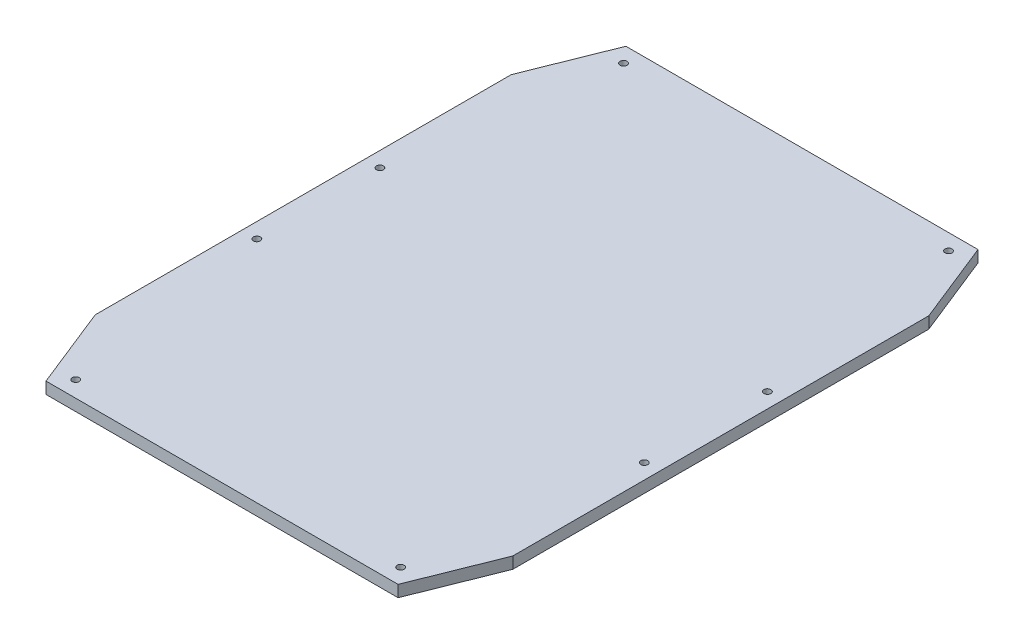
ISO-10303-21;
HEADER;
FILE_DESCRIPTION(('STEP AP214'),'2;1');
FILE_NAME('part.step','',(''),(''),'','','');
FILE_SCHEMA(('AUTOMOTIVE_DESIGN { 1 0 10303 214 1 1 1 1 }'));
ENDSEC;
DATA;
#1=APPLICATION_CONTEXT('core data for automotive mechanical design processes');
#2=APPLICATION_PROTOCOL_DEFINITION('international standard','automotive_design',2000,#1);
#3=PRODUCT_CONTEXT('',#1,'mechanical');
#4=PRODUCT('Part','Part','',(#3));
#5=PRODUCT_RELATED_PRODUCT_CATEGORY('part','',(#4));
#6=PRODUCT_DEFINITION_FORMATION('','',#4);
#7=PRODUCT_DEFINITION_CONTEXT('part definition',#1,'design');
#8=PRODUCT_DEFINITION('design','',#6,#7);
#9=PRODUCT_DEFINITION_SHAPE('','',#8);
#10=(LENGTH_UNIT() NAMED_UNIT(*) SI_UNIT(.MILLI.,.METRE.));
#11=(NAMED_UNIT(*) PLANE_ANGLE_UNIT() SI_UNIT($,.RADIAN.));
#12=(NAMED_UNIT(*) SI_UNIT($,.STERADIAN.) SOLID_ANGLE_UNIT());
#13=UNCERTAINTY_MEASURE_WITH_UNIT(LENGTH_MEASURE(1.E-05),#10,'distance_accuracy_value','');
#14=(GEOMETRIC_REPRESENTATION_CONTEXT(3) GLOBAL_UNCERTAINTY_ASSIGNED_CONTEXT((#13)) GLOBAL_UNIT_ASSIGNED_CONTEXT((#10,
#11,#12)) REPRESENTATION_CONTEXT('',''));
#15=CARTESIAN_POINT('',(0.,0.,0.));
#16=DIRECTION('',(0.,0.,1.));
#17=DIRECTION('',(1.,0.,0.));
#18=AXIS2_PLACEMENT_3D('',#15,#16,#17);
#19=CARTESIAN_POINT('',(0.,5.,0.));
#20=DIRECTION('',(0.928485826880912,0.,-0.371367835550239));
#21=DIRECTION('',(-0.371367835550239,0.,-0.928485826880912));
#22=AXIS2_PLACEMENT_3D('',#19,#20,#21);
#23=PLANE('',#22);
#24=DIRECTION('',(0.371367835550239,0.,0.928485826880912));
#25=VECTOR('',#24,1.);
#26=CARTESIAN_POINT('',(0.,0.,0.));
#27=LINE('',#26,#25);
#28=CARTESIAN_POINT('',(-14.1231187859756,0.,-35.3103159962811));
#29=VERTEX_POINT('',#28);
#30=CARTESIAN_POINT('',(0.,0.,0.));
#31=VERTEX_POINT('',#30);
#32=EDGE_CURVE('E147',#29,#31,#27,.T.);
#33=ORIENTED_EDGE('',*,*,#32,.T.);
#34=DIRECTION('',(0.,-1.,0.));
#35=VECTOR('',#34,1.);
#36=CARTESIAN_POINT('',(0.,5.,0.));
#37=LINE('',#36,#35);
#38=CARTESIAN_POINT('',(0.,5.,0.));
#39=VERTEX_POINT('',#38);
#40=EDGE_CURVE('E11',#39,#31,#37,.T.);
#41=ORIENTED_EDGE('',*,*,#40,.F.);
#42=DIRECTION('',(0.371367835550239,0.,0.928485826880912));
#43=VECTOR('',#42,1.);
#44=CARTESIAN_POINT('',(0.,5.,0.));
#45=LINE('',#44,#43);
#46=CARTESIAN_POINT('',(-14.1231187859756,5.,-35.3103159962811));
#47=VERTEX_POINT('',#46);
#48=EDGE_CURVE('E169',#47,#39,#45,.T.);
#49=ORIENTED_EDGE('',*,*,#48,.F.);
#50=DIRECTION('',(0.,-1.,0.));
#51=VECTOR('',#50,1.);
#52=CARTESIAN_POINT('',(-14.1231187859756,5.,-35.3103159962811));
#53=LINE('',#52,#51);
#54=EDGE_CURVE('E143',#47,#29,#53,.T.);
#55=ORIENTED_EDGE('',*,*,#54,.T.);
#56=EDGE_LOOP('',(#33,#41,#49,#55));
#57=FACE_BOUND('',#56,.T.);
#58=ADVANCED_FACE('F44',(#57),#23,.F.);
#59=CARTESIAN_POINT('',(0.,5.,0.));
#60=DIRECTION('',(0.,0.,-1.));
#61=DIRECTION('',(-1.,0.,0.));
#62=AXIS2_PLACEMENT_3D('',#59,#60,#61);
#63=PLANE('',#62);
#64=DIRECTION('',(1.,0.,0.));
#65=VECTOR('',#64,1.);
#66=CARTESIAN_POINT('',(0.,0.,0.));
#67=LINE('',#66,#65);
#68=CARTESIAN_POINT('',(151.72,0.,0.));
#69=VERTEX_POINT('',#68);
#70=EDGE_CURVE('E151',#31,#69,#67,.T.);
#71=ORIENTED_EDGE('',*,*,#70,.T.);
#72=DIRECTION('',(0.,-1.,0.));
#73=VECTOR('',#72,1.);
#74=CARTESIAN_POINT('',(151.72,5.,0.));
#75=LINE('',#74,#73);
#76=CARTESIAN_POINT('',(151.72,5.,0.));
#77=VERTEX_POINT('',#76);
#78=EDGE_CURVE('E54',#77,#69,#75,.T.);
#79=ORIENTED_EDGE('',*,*,#78,.F.);
#80=DIRECTION('',(1.,0.,0.));
#81=VECTOR('',#80,1.);
#82=CARTESIAN_POINT('',(0.,5.,0.));
#83=LINE('',#82,#81);
#84=EDGE_CURVE('E106',#39,#77,#83,.T.);
#85=ORIENTED_EDGE('',*,*,#84,.F.);
#86=ORIENTED_EDGE('',*,*,#40,.T.);
#87=EDGE_LOOP('',(#71,#79,#85,#86));
#88=FACE_BOUND('',#87,.T.);
#89=ADVANCED_FACE('F258',(#88),#63,.F.);
#90=CARTESIAN_POINT('',(151.72,5.,0.));
#91=DIRECTION('',(-0.928485826880912,0.,-0.37136783555024));
#92=DIRECTION('',(-0.37136783555024,0.,0.928485826880912));
#93=AXIS2_PLACEMENT_3D('',#90,#91,#92);
#94=PLANE('',#93);
#95=DIRECTION('',(0.37136783555024,0.,-0.928485826880912));
#96=VECTOR('',#95,1.);
#97=CARTESIAN_POINT('',(151.72,0.,0.));
#98=LINE('',#97,#96);
#99=CARTESIAN_POINT('',(165.843118785976,0.,-35.3103159962811));
#100=VERTEX_POINT('',#99);
#101=EDGE_CURVE('E154',#69,#100,#98,.T.);
#102=ORIENTED_EDGE('',*,*,#101,.T.);
#103=DIRECTION('',(0.,-1.,0.));
#104=VECTOR('',#103,1.);
#105=CARTESIAN_POINT('',(165.843118785976,5.,-35.3103159962811));
#106=LINE('',#105,#104);
#107=CARTESIAN_POINT('',(165.843118785976,5.,-35.3103159962811));
#108=VERTEX_POINT('',#107);
#109=EDGE_CURVE('E180',#108,#100,#106,.T.);
#110=ORIENTED_EDGE('',*,*,#109,.F.);
#111=DIRECTION('',(0.37136783555024,0.,-0.928485826880912));
#112=VECTOR('',#111,1.);
#113=CARTESIAN_POINT('',(151.72,5.,0.));
#114=LINE('',#113,#112);
#115=EDGE_CURVE('E476',#77,#108,#114,.T.);
#116=ORIENTED_EDGE('',*,*,#115,.F.);
#117=ORIENTED_EDGE('',*,*,#78,.T.);
#118=EDGE_LOOP('',(#102,#110,#116,#117));
#119=FACE_BOUND('',#118,.T.);
#120=ADVANCED_FACE('F262',(#119),#94,.F.);
#121=CARTESIAN_POINT('',(165.843118785976,5.,-35.3103159962811));
#122=DIRECTION('',(-1.,0.,0.));
#123=DIRECTION('',(0.,0.,1.));
#124=AXIS2_PLACEMENT_3D('',#121,#122,#123);
#125=PLANE('',#124);
#126=DIRECTION('',(0.,0.,-1.));
#127=VECTOR('',#126,1.);
#128=CARTESIAN_POINT('',(165.843118785976,0.,-35.3103159962811));
#129=LINE('',#128,#127);
#130=CARTESIAN_POINT('',(165.843118785976,0.,-214.600315996281));
#131=VERTEX_POINT('',#130);
#132=EDGE_CURVE('E157',#100,#131,#129,.T.);
#133=ORIENTED_EDGE('',*,*,#132,.T.);
#134=DIRECTION('',(0.,-1.,0.));
#135=VECTOR('',#134,1.);
#136=CARTESIAN_POINT('',(165.843118785976,5.,-214.600315996281));
#137=LINE('',#136,#135);
#138=CARTESIAN_POINT('',(165.843118785976,5.,-214.600315996281));
#139=VERTEX_POINT('',#138);
#140=EDGE_CURVE('E176',#139,#131,#137,.T.);
#141=ORIENTED_EDGE('',*,*,#140,.F.);
#142=DIRECTION('',(0.,0.,-1.));
#143=VECTOR('',#142,1.);
#144=CARTESIAN_POINT('',(165.843118785976,5.,-35.3103159962811));
#145=LINE('',#144,#143);
#146=EDGE_CURVE('E479',#108,#139,#145,.T.);
#147=ORIENTED_EDGE('',*,*,#146,.F.);
#148=ORIENTED_EDGE('',*,*,#109,.T.);
#149=EDGE_LOOP('',(#133,#141,#147,#148));
#150=FACE_BOUND('',#149,.T.);
#151=ADVANCED_FACE('F266',(#150),#125,.F.);
#152=CARTESIAN_POINT('',(151.72,5.,-249.910631992562));
#153=DIRECTION('',(-0.928485826880911,0.,0.37136783555024));
#154=DIRECTION('',(0.37136783555024,0.,0.928485826880911));
#155=AXIS2_PLACEMENT_3D('',#152,#153,#154);
#156=PLANE('',#155);
#157=DIRECTION('',(-0.37136783555024,0.,-0.928485826880911));
#158=VECTOR('',#157,1.);
#159=CARTESIAN_POINT('',(151.72,0.,-249.910631992562));
#160=LINE('',#159,#158);
#161=CARTESIAN_POINT('',(151.72,0.,-249.910631992562));
#162=VERTEX_POINT('',#161);
#163=EDGE_CURVE('E160',#131,#162,#160,.T.);
#164=ORIENTED_EDGE('',*,*,#163,.T.);
#165=DIRECTION('',(0.,-1.,0.));
#166=VECTOR('',#165,1.);
#167=CARTESIAN_POINT('',(151.72,5.,-249.910631992562));
#168=LINE('',#167,#166);
#169=CARTESIAN_POINT('',(151.72,5.,-249.910631992562));
#170=VERTEX_POINT('',#169);
#171=EDGE_CURVE('E136',#170,#162,#168,.T.);
#172=ORIENTED_EDGE('',*,*,#171,.F.);
#173=DIRECTION('',(-0.37136783555024,0.,-0.928485826880911));
#174=VECTOR('',#173,1.);
#175=CARTESIAN_POINT('',(151.72,5.,-249.910631992562));
#176=LINE('',#175,#174);
#177=EDGE_CURVE('E125',#139,#170,#176,.T.);
#178=ORIENTED_EDGE('',*,*,#177,.F.);
#179=ORIENTED_EDGE('',*,*,#140,.T.);
#180=EDGE_LOOP('',(#164,#172,#178,#179));
#181=FACE_BOUND('',#180,.T.);
#182=ADVANCED_FACE('F272',(#181),#156,.F.);
#183=CARTESIAN_POINT('',(0.,5.,-249.910631992562));
#184=DIRECTION('',(0.,0.,1.));
#185=DIRECTION('',(1.,0.,0.));
#186=AXIS2_PLACEMENT_3D('',#183,#184,#185);
#187=PLANE('',#186);
#188=DIRECTION('',(-1.,0.,0.));
#189=VECTOR('',#188,1.);
#190=CARTESIAN_POINT('',(0.,0.,-249.910631992562));
#191=LINE('',#190,#189);
#192=CARTESIAN_POINT('',(0.,0.,-249.910631992562));
#193=VERTEX_POINT('',#192);
#194=EDGE_CURVE('E134',#162,#193,#191,.T.);
#195=ORIENTED_EDGE('',*,*,#194,.T.);
#196=DIRECTION('',(0.,-1.,0.));
#197=VECTOR('',#196,1.);
#198=CARTESIAN_POINT('',(0.,5.,-249.910631992562));
#199=LINE('',#198,#197);
#200=CARTESIAN_POINT('',(0.,5.,-249.910631992562));
#201=VERTEX_POINT('',#200);
#202=EDGE_CURVE('E131',#201,#193,#199,.T.);
#203=ORIENTED_EDGE('',*,*,#202,.F.);
#204=DIRECTION('',(-1.,0.,0.));
#205=VECTOR('',#204,1.);
#206=CARTESIAN_POINT('',(0.,5.,-249.910631992562));
#207=LINE('',#206,#205);
#208=EDGE_CURVE('E119',#170,#201,#207,.T.);
#209=ORIENTED_EDGE('',*,*,#208,.F.);
#210=ORIENTED_EDGE('',*,*,#171,.T.);
#211=EDGE_LOOP('',(#195,#203,#209,#210));
#212=FACE_BOUND('',#211,.T.);
#213=ADVANCED_FACE('F132',(#212),#187,.F.);
#214=CARTESIAN_POINT('',(0.,5.,-249.910631992562));
#215=DIRECTION('',(0.928485826880912,0.,0.37136783555024));
#216=DIRECTION('',(0.37136783555024,0.,-0.928485826880912));
#217=AXIS2_PLACEMENT_3D('',#214,#215,#216);
#218=PLANE('',#217);
#219=DIRECTION('',(-0.37136783555024,0.,0.928485826880911));
#220=VECTOR('',#219,1.);
#221=CARTESIAN_POINT('',(0.,0.,-249.910631992562));
#222=LINE('',#221,#220);
#223=CARTESIAN_POINT('',(-14.1231187859756,0.,-214.600315996281));
#224=VERTEX_POINT('',#223);
#225=EDGE_CURVE('E92',#193,#224,#222,.T.);
#226=ORIENTED_EDGE('',*,*,#225,.T.);
#227=DIRECTION('',(0.,-1.,0.));
#228=VECTOR('',#227,1.);
#229=CARTESIAN_POINT('',(-14.1231187859756,5.,-214.600315996281));
#230=LINE('',#229,#228);
#231=CARTESIAN_POINT('',(-14.1231187859756,5.,-214.600315996281));
#232=VERTEX_POINT('',#231);
#233=EDGE_CURVE('E137',#232,#224,#230,.T.);
#234=ORIENTED_EDGE('',*,*,#233,.F.);
#235=DIRECTION('',(-0.37136783555024,0.,0.928485826880911));
#236=VECTOR('',#235,1.);
#237=CARTESIAN_POINT('',(0.,5.,-249.910631992562));
#238=LINE('',#237,#236);
#239=EDGE_CURVE('E123',#201,#232,#238,.T.);
#240=ORIENTED_EDGE('',*,*,#239,.F.);
#241=ORIENTED_EDGE('',*,*,#202,.T.);
#242=EDGE_LOOP('',(#226,#234,#240,#241));
#243=FACE_BOUND('',#242,.T.);
#244=ADVANCED_FACE('F139',(#243),#218,.F.);
#245=CARTESIAN_POINT('',(-14.1231187859756,5.,-35.3103159962811));
#246=DIRECTION('',(1.,0.,0.));
#247=DIRECTION('',(0.,0.,-1.));
#248=AXIS2_PLACEMENT_3D('',#245,#246,#247);
#249=PLANE('',#248);
#250=DIRECTION('',(0.,0.,1.));
#251=VECTOR('',#250,1.);
#252=CARTESIAN_POINT('',(-14.1231187859756,0.,-35.3103159962811));
#253=LINE('',#252,#251);
#254=EDGE_CURVE('E98',#224,#29,#253,.T.);
#255=ORIENTED_EDGE('',*,*,#254,.T.);
#256=ORIENTED_EDGE('',*,*,#54,.F.);
#257=DIRECTION('',(0.,0.,1.));
#258=VECTOR('',#257,1.);
#259=CARTESIAN_POINT('',(-14.1231187859756,5.,-35.3103159962811));
#260=LINE('',#259,#258);
#261=EDGE_CURVE('E63',#232,#47,#260,.T.);
#262=ORIENTED_EDGE('',*,*,#261,.F.);
#263=ORIENTED_EDGE('',*,*,#233,.T.);
#264=EDGE_LOOP('',(#255,#256,#262,#263));
#265=FACE_BOUND('',#264,.T.);
#266=ADVANCED_FACE('F246',(#265),#249,.F.);
#267=CARTESIAN_POINT('',(0.,5.,0.));
#268=DIRECTION('',(0.,-1.,0.));
#269=DIRECTION('',(0.,0.,-1.));
#270=AXIS2_PLACEMENT_3D('',#267,#268,#269);
#271=PLANE('',#270);
#272=CARTESIAN_POINT('',(145.883373814949,5.,-6.95212776511848));
#273=DIRECTION('',(0.,1.,0.));
#274=DIRECTION('',(0.,0.,1.));
#275=AXIS2_PLACEMENT_3D('',#272,#273,#274);
#276=CIRCLE('',#275,1.5);
#277=CARTESIAN_POINT('',(145.883373814949,5.,-5.45212776511848));
#278=VERTEX_POINT('',#277);
#279=EDGE_CURVE('E453',#278,#278,#276,.T.);
#280=ORIENTED_EDGE('',*,*,#279,.F.);
#281=EDGE_LOOP('',(#280));
#282=FACE_BOUND('',#281,.T.);
#283=CARTESIAN_POINT('',(5.84089743251317,5.,-6.95212776511853));
#284=DIRECTION('',(0.,1.,0.));
#285=DIRECTION('',(0.,0.,1.));
#286=AXIS2_PLACEMENT_3D('',#283,#284,#285);
#287=CIRCLE('',#286,1.5);
#288=CARTESIAN_POINT('',(5.84089743251317,5.,-5.45212776511853));
#289=VERTEX_POINT('',#288);
#290=EDGE_CURVE('E450',#289,#289,#287,.T.);
#291=ORIENTED_EDGE('',*,*,#290,.F.);
#292=EDGE_LOOP('',(#291));
#293=FACE_BOUND('',#292,.T.);
#294=CARTESIAN_POINT('',(-7.61571773084433,5.,-98.4778533545754));
#295=DIRECTION('',(0.,1.,0.));
#296=DIRECTION('',(0.,0.,1.));
#297=AXIS2_PLACEMENT_3D('',#294,#295,#296);
#298=CIRCLE('',#297,1.5);
#299=CARTESIAN_POINT('',(-7.61571773084433,5.,-96.9778533545754));
#300=VERTEX_POINT('',#299);
#301=EDGE_CURVE('E454',#300,#300,#298,.T.);
#302=ORIENTED_EDGE('',*,*,#301,.F.);
#303=EDGE_LOOP('',(#302));
#304=FACE_BOUND('',#303,.T.);
#305=CARTESIAN_POINT('',(-7.61571773084433,5.,-151.522146645424));
#306=DIRECTION('',(0.,1.,0.));
#307=DIRECTION('',(0.,0.,1.));
#308=AXIS2_PLACEMENT_3D('',#305,#306,#307);
#309=CIRCLE('',#308,1.49999999999998);
#310=CARTESIAN_POINT('',(-7.61571773084433,5.,-150.022146645424));
#311=VERTEX_POINT('',#310);
#312=EDGE_CURVE('E461',#311,#311,#309,.T.);
#313=ORIENTED_EDGE('',*,*,#312,.F.);
#314=EDGE_LOOP('',(#313));
#315=FACE_BOUND('',#314,.T.);
#316=CARTESIAN_POINT('',(5.84089743251317,5.,-243.047872234881));
#317=DIRECTION('',(0.,1.,0.));
#318=DIRECTION('',(0.,0.,1.));
#319=AXIS2_PLACEMENT_3D('',#316,#317,#318);
#320=CIRCLE('',#319,1.5);
#321=CARTESIAN_POINT('',(5.84089743251317,5.,-241.547872234881));
#322=VERTEX_POINT('',#321);
#323=EDGE_CURVE('E468',#322,#322,#320,.T.);
#324=ORIENTED_EDGE('',*,*,#323,.F.);
#325=EDGE_LOOP('',(#324));
#326=FACE_BOUND('',#325,.T.);
#327=CARTESIAN_POINT('',(145.883373814949,5.,-243.047872234881));
#328=DIRECTION('',(0.,1.,0.));
#329=DIRECTION('',(0.,0.,1.));
#330=AXIS2_PLACEMENT_3D('',#327,#328,#329);
#331=CIRCLE('',#330,1.5);
#332=CARTESIAN_POINT('',(145.883373814949,5.,-241.547872234881));
#333=VERTEX_POINT('',#332);
#334=EDGE_CURVE('E495',#333,#333,#331,.T.);
#335=ORIENTED_EDGE('',*,*,#334,.F.);
#336=EDGE_LOOP('',(#335));
#337=FACE_BOUND('',#336,.T.);
#338=CARTESIAN_POINT('',(159.339988978307,5.,-151.522146645424));
#339=DIRECTION('',(0.,1.,0.));
#340=DIRECTION('',(0.,0.,1.));
#341=AXIS2_PLACEMENT_3D('',#338,#339,#340);
#342=CIRCLE('',#341,1.5);
#343=CARTESIAN_POINT('',(159.339988978307,5.,-150.022146645424));
#344=VERTEX_POINT('',#343);
#345=EDGE_CURVE('E501',#344,#344,#342,.T.);
#346=ORIENTED_EDGE('',*,*,#345,.F.);
#347=EDGE_LOOP('',(#346));
#348=FACE_BOUND('',#347,.T.);
#349=CARTESIAN_POINT('',(159.339988978307,5.,-98.4778533545754));
#350=DIRECTION('',(0.,1.,0.));
#351=DIRECTION('',(0.,0.,1.));
#352=AXIS2_PLACEMENT_3D('',#349,#350,#351);
#353=CIRCLE('',#352,1.5);
#354=CARTESIAN_POINT('',(159.339988978307,5.,-96.9778533545754));
#355=VERTEX_POINT('',#354);
#356=EDGE_CURVE('E192',#355,#355,#353,.T.);
#357=ORIENTED_EDGE('',*,*,#356,.F.);
#358=EDGE_LOOP('',(#357));
#359=FACE_BOUND('',#358,.T.);
#360=ORIENTED_EDGE('',*,*,#48,.T.);
#361=ORIENTED_EDGE('',*,*,#84,.T.);
#362=ORIENTED_EDGE('',*,*,#115,.T.);
#363=ORIENTED_EDGE('',*,*,#146,.T.);
#364=ORIENTED_EDGE('',*,*,#177,.T.);
#365=ORIENTED_EDGE('',*,*,#208,.T.);
#366=ORIENTED_EDGE('',*,*,#239,.T.);
#367=ORIENTED_EDGE('',*,*,#261,.T.);
#368=EDGE_LOOP('',(#360,#361,#362,#363,#364,#365,#366,#367));
#369=FACE_BOUND('',#368,.T.);
#370=ADVANCED_FACE('F121',(#282,#293,#304,#315,#326,#337,#348,#359,#369),#271,.F.);
#371=CARTESIAN_POINT('',(0.,0.,0.));
#372=DIRECTION('',(0.,-1.,0.));
#373=DIRECTION('',(0.,0.,-1.));
#374=AXIS2_PLACEMENT_3D('',#371,#372,#373);
#375=PLANE('',#374);
#376=CARTESIAN_POINT('',(145.883373814949,0.,-6.95212776511848));
#377=DIRECTION('',(0.,-1.,0.));
#378=DIRECTION('',(0.,0.,-1.));
#379=AXIS2_PLACEMENT_3D('',#376,#377,#378);
#380=CIRCLE('',#379,1.5);
#381=CARTESIAN_POINT('',(145.883373814949,0.,-8.45212776511848));
#382=VERTEX_POINT('',#381);
#383=EDGE_CURVE('E47',#382,#382,#380,.T.);
#384=ORIENTED_EDGE('',*,*,#383,.F.);
#385=EDGE_LOOP('',(#384));
#386=FACE_BOUND('',#385,.T.);
#387=CARTESIAN_POINT('',(5.84089743251317,0.,-6.95212776511853));
#388=DIRECTION('',(0.,-1.,0.));
#389=DIRECTION('',(0.,0.,-1.));
#390=AXIS2_PLACEMENT_3D('',#387,#388,#389);
#391=CIRCLE('',#390,1.5);
#392=CARTESIAN_POINT('',(5.84089743251317,0.,-8.45212776511853));
#393=VERTEX_POINT('',#392);
#394=EDGE_CURVE('E211',#393,#393,#391,.T.);
#395=ORIENTED_EDGE('',*,*,#394,.F.);
#396=EDGE_LOOP('',(#395));
#397=FACE_BOUND('',#396,.T.);
#398=CARTESIAN_POINT('',(-7.61571773084433,0.,-98.4778533545754));
#399=DIRECTION('',(0.,-1.,0.));
#400=DIRECTION('',(0.,0.,-1.));
#401=AXIS2_PLACEMENT_3D('',#398,#399,#400);
#402=CIRCLE('',#401,1.5);
#403=CARTESIAN_POINT('',(-7.61571773084433,0.,-99.9778533545754));
#404=VERTEX_POINT('',#403);
#405=EDGE_CURVE('E208',#404,#404,#402,.T.);
#406=ORIENTED_EDGE('',*,*,#405,.F.);
#407=EDGE_LOOP('',(#406));
#408=FACE_BOUND('',#407,.T.);
#409=CARTESIAN_POINT('',(-7.61571773084433,0.,-151.522146645424));
#410=DIRECTION('',(0.,-1.,0.));
#411=DIRECTION('',(0.,0.,-1.));
#412=AXIS2_PLACEMENT_3D('',#409,#410,#411);
#413=CIRCLE('',#412,1.49999999999998);
#414=CARTESIAN_POINT('',(-7.61571773084433,0.,-153.022146645424));
#415=VERTEX_POINT('',#414);
#416=EDGE_CURVE('E204',#415,#415,#413,.T.);
#417=ORIENTED_EDGE('',*,*,#416,.F.);
#418=EDGE_LOOP('',(#417));
#419=FACE_BOUND('',#418,.T.);
#420=CARTESIAN_POINT('',(5.84089743251317,0.,-243.047872234881));
#421=DIRECTION('',(0.,-1.,0.));
#422=DIRECTION('',(0.,0.,-1.));
#423=AXIS2_PLACEMENT_3D('',#420,#421,#422);
#424=CIRCLE('',#423,1.5);
#425=CARTESIAN_POINT('',(5.84089743251317,0.,-244.547872234881));
#426=VERTEX_POINT('',#425);
#427=EDGE_CURVE('E200',#426,#426,#424,.T.);
#428=ORIENTED_EDGE('',*,*,#427,.F.);
#429=EDGE_LOOP('',(#428));
#430=FACE_BOUND('',#429,.T.);
#431=CARTESIAN_POINT('',(145.883373814949,0.,-243.047872234881));
#432=DIRECTION('',(0.,-1.,0.));
#433=DIRECTION('',(0.,0.,-1.));
#434=AXIS2_PLACEMENT_3D('',#431,#432,#433);
#435=CIRCLE('',#434,1.5);
#436=CARTESIAN_POINT('',(145.883373814949,0.,-244.547872234881));
#437=VERTEX_POINT('',#436);
#438=EDGE_CURVE('E196',#437,#437,#435,.T.);
#439=ORIENTED_EDGE('',*,*,#438,.F.);
#440=EDGE_LOOP('',(#439));
#441=FACE_BOUND('',#440,.T.);
#442=CARTESIAN_POINT('',(159.339988978307,0.,-151.522146645424));
#443=DIRECTION('',(0.,-1.,0.));
#444=DIRECTION('',(0.,0.,-1.));
#445=AXIS2_PLACEMENT_3D('',#442,#443,#444);
#446=CIRCLE('',#445,1.5);
#447=CARTESIAN_POINT('',(159.339988978307,0.,-153.022146645424));
#448=VERTEX_POINT('',#447);
#449=EDGE_CURVE('E191',#448,#448,#446,.T.);
#450=ORIENTED_EDGE('',*,*,#449,.F.);
#451=EDGE_LOOP('',(#450));
#452=FACE_BOUND('',#451,.T.);
#453=CARTESIAN_POINT('',(159.339988978307,0.,-98.4778533545754));
#454=DIRECTION('',(0.,-1.,0.));
#455=DIRECTION('',(0.,0.,-1.));
#456=AXIS2_PLACEMENT_3D('',#453,#454,#455);
#457=CIRCLE('',#456,1.5);
#458=CARTESIAN_POINT('',(159.339988978307,0.,-99.9778533545754));
#459=VERTEX_POINT('',#458);
#460=EDGE_CURVE('E187',#459,#459,#457,.T.);
#461=ORIENTED_EDGE('',*,*,#460,.F.);
#462=EDGE_LOOP('',(#461));
#463=FACE_BOUND('',#462,.T.);
#464=ORIENTED_EDGE('',*,*,#32,.F.);
#465=ORIENTED_EDGE('',*,*,#254,.F.);
#466=ORIENTED_EDGE('',*,*,#225,.F.);
#467=ORIENTED_EDGE('',*,*,#194,.F.);
#468=ORIENTED_EDGE('',*,*,#163,.F.);
#469=ORIENTED_EDGE('',*,*,#132,.F.);
#470=ORIENTED_EDGE('',*,*,#101,.F.);
#471=ORIENTED_EDGE('',*,*,#70,.F.);
#472=EDGE_LOOP('',(#464,#465,#466,#467,#468,#469,#470,#471));
#473=FACE_BOUND('',#472,.T.);
#474=ADVANCED_FACE('F223',(#386,#397,#408,#419,#430,#441,#452,#463,#473),#375,.T.);
#475=CARTESIAN_POINT('',(159.339988978307,-5.,-98.4778533545754));
#476=DIRECTION('',(0.,1.,0.));
#477=DIRECTION('',(0.,0.,1.));
#478=AXIS2_PLACEMENT_3D('',#475,#476,#477);
#479=CYLINDRICAL_SURFACE('',#478,1.5);
#480=ORIENTED_EDGE('',*,*,#460,.T.);
#481=EDGE_LOOP('',(#480));
#482=FACE_BOUND('',#481,.T.);
#483=ORIENTED_EDGE('',*,*,#356,.T.);
#484=EDGE_LOOP('',(#483));
#485=FACE_BOUND('',#484,.T.);
#486=ADVANCED_FACE('F226',(#482,#485),#479,.F.);
#487=CARTESIAN_POINT('',(159.339988978307,-5.,-151.522146645424));
#488=DIRECTION('',(0.,1.,0.));
#489=DIRECTION('',(0.,0.,1.));
#490=AXIS2_PLACEMENT_3D('',#487,#488,#489);
#491=CYLINDRICAL_SURFACE('',#490,1.5);
#492=ORIENTED_EDGE('',*,*,#449,.T.);
#493=EDGE_LOOP('',(#492));
#494=FACE_BOUND('',#493,.T.);
#495=ORIENTED_EDGE('',*,*,#345,.T.);
#496=EDGE_LOOP('',(#495));
#497=FACE_BOUND('',#496,.T.);
#498=ADVANCED_FACE('F312',(#494,#497),#491,.F.);
#499=CARTESIAN_POINT('',(145.883373814949,-5.,-243.047872234881));
#500=DIRECTION('',(0.,1.,0.));
#501=DIRECTION('',(0.,0.,1.));
#502=AXIS2_PLACEMENT_3D('',#499,#500,#501);
#503=CYLINDRICAL_SURFACE('',#502,1.5);
#504=ORIENTED_EDGE('',*,*,#438,.T.);
#505=EDGE_LOOP('',(#504));
#506=FACE_BOUND('',#505,.T.);
#507=ORIENTED_EDGE('',*,*,#334,.T.);
#508=EDGE_LOOP('',(#507));
#509=FACE_BOUND('',#508,.T.);
#510=ADVANCED_FACE('F323',(#506,#509),#503,.F.);
#511=CARTESIAN_POINT('',(5.84089743251317,-5.,-243.047872234881));
#512=DIRECTION('',(0.,1.,0.));
#513=DIRECTION('',(0.,0.,1.));
#514=AXIS2_PLACEMENT_3D('',#511,#512,#513);
#515=CYLINDRICAL_SURFACE('',#514,1.5);
#516=ORIENTED_EDGE('',*,*,#427,.T.);
#517=EDGE_LOOP('',(#516));
#518=FACE_BOUND('',#517,.T.);
#519=ORIENTED_EDGE('',*,*,#323,.T.);
#520=EDGE_LOOP('',(#519));
#521=FACE_BOUND('',#520,.T.);
#522=ADVANCED_FACE('F334',(#518,#521),#515,.F.);
#523=CARTESIAN_POINT('',(-7.61571773084433,-5.,-151.522146645424));
#524=DIRECTION('',(0.,1.,0.));
#525=DIRECTION('',(0.,0.,1.));
#526=AXIS2_PLACEMENT_3D('',#523,#524,#525);
#527=CYLINDRICAL_SURFACE('',#526,1.49999999999998);
#528=ORIENTED_EDGE('',*,*,#416,.T.);
#529=EDGE_LOOP('',(#528));
#530=FACE_BOUND('',#529,.T.);
#531=ORIENTED_EDGE('',*,*,#312,.T.);
#532=EDGE_LOOP('',(#531));
#533=FACE_BOUND('',#532,.T.);
#534=ADVANCED_FACE('F345',(#530,#533),#527,.F.);
#535=CARTESIAN_POINT('',(-7.61571773084433,-5.,-98.4778533545754));
#536=DIRECTION('',(0.,1.,0.));
#537=DIRECTION('',(0.,0.,1.));
#538=AXIS2_PLACEMENT_3D('',#535,#536,#537);
#539=CYLINDRICAL_SURFACE('',#538,1.5);
#540=ORIENTED_EDGE('',*,*,#405,.T.);
#541=EDGE_LOOP('',(#540));
#542=FACE_BOUND('',#541,.T.);
#543=ORIENTED_EDGE('',*,*,#301,.T.);
#544=EDGE_LOOP('',(#543));
#545=FACE_BOUND('',#544,.T.);
#546=ADVANCED_FACE('F356',(#542,#545),#539,.F.);
#547=CARTESIAN_POINT('',(5.84089743251317,-5.,-6.95212776511853));
#548=DIRECTION('',(0.,1.,0.));
#549=DIRECTION('',(0.,0.,1.));
#550=AXIS2_PLACEMENT_3D('',#547,#548,#549);
#551=CYLINDRICAL_SURFACE('',#550,1.5);
#552=ORIENTED_EDGE('',*,*,#394,.T.);
#553=EDGE_LOOP('',(#552));
#554=FACE_BOUND('',#553,.T.);
#555=ORIENTED_EDGE('',*,*,#290,.T.);
#556=EDGE_LOOP('',(#555));
#557=FACE_BOUND('',#556,.T.);
#558=ADVANCED_FACE('F367',(#554,#557),#551,.F.);
#559=CARTESIAN_POINT('',(145.883373814949,-5.,-6.95212776511848));
#560=DIRECTION('',(0.,1.,0.));
#561=DIRECTION('',(0.,0.,1.));
#562=AXIS2_PLACEMENT_3D('',#559,#560,#561);
#563=CYLINDRICAL_SURFACE('',#562,1.5);
#564=ORIENTED_EDGE('',*,*,#383,.T.);
#565=EDGE_LOOP('',(#564));
#566=FACE_BOUND('',#565,.T.);
#567=ORIENTED_EDGE('',*,*,#279,.T.);
#568=EDGE_LOOP('',(#567));
#569=FACE_BOUND('',#568,.T.);
#570=ADVANCED_FACE('F220',(#566,#569),#563,.F.);
#571=CLOSED_SHELL('',(#58,#89,#120,#151,#182,#213,#244,#266,#370,#474,#486,#498,#510,#522,#534,
#546,#558,#570));
#572=MANIFOLD_SOLID_BREP('B2',#571);
#573=ADVANCED_BREP_SHAPE_REPRESENTATION('',(#18,#572),#14);
#574=SHAPE_DEFINITION_REPRESENTATION(#9,#573);
ENDSEC;
END-ISO-10303-21;
